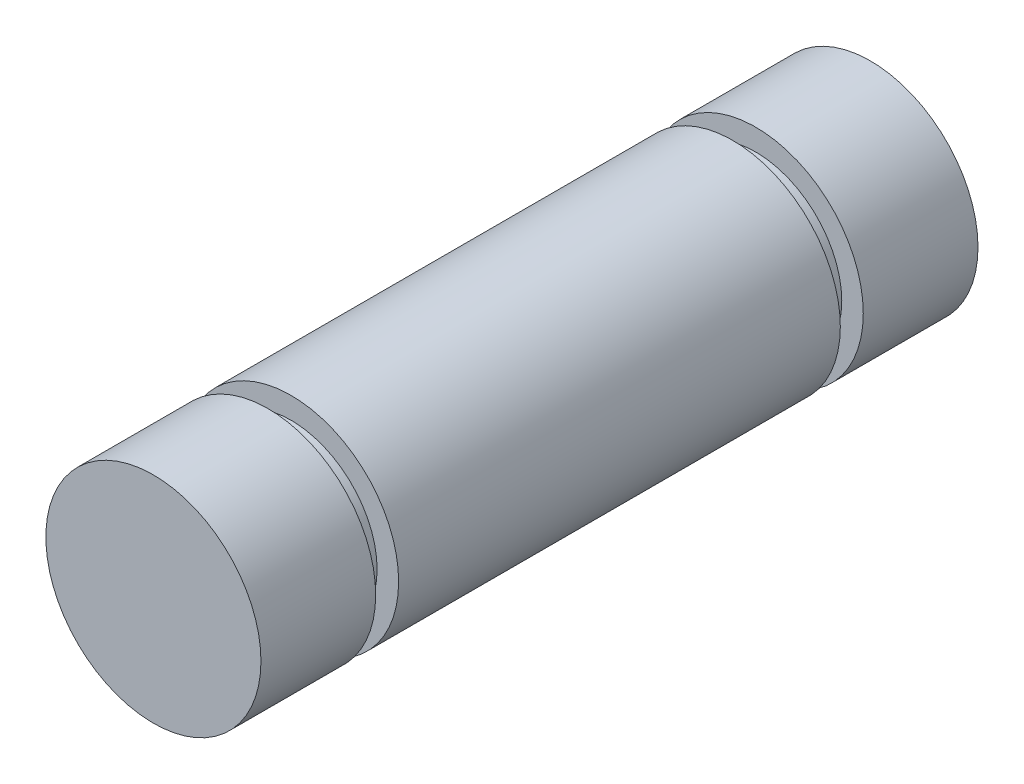
ISO-10303-21;
HEADER;
FILE_DESCRIPTION(('STEP AP214'),'2;1');
FILE_NAME('part.step','',(''),(''),'','','');
FILE_SCHEMA(('AUTOMOTIVE_DESIGN { 1 0 10303 214 1 1 1 1 }'));
ENDSEC;
DATA;
#1=APPLICATION_CONTEXT('core data for automotive mechanical design processes');
#2=APPLICATION_PROTOCOL_DEFINITION('international standard','automotive_design',2000,#1);
#3=PRODUCT_CONTEXT('',#1,'mechanical');
#4=PRODUCT('Part','Part','',(#3));
#5=PRODUCT_RELATED_PRODUCT_CATEGORY('part','',(#4));
#6=PRODUCT_DEFINITION_FORMATION('','',#4);
#7=PRODUCT_DEFINITION_CONTEXT('part definition',#1,'design');
#8=PRODUCT_DEFINITION('design','',#6,#7);
#9=PRODUCT_DEFINITION_SHAPE('','',#8);
#10=(LENGTH_UNIT() NAMED_UNIT(*) SI_UNIT(.MILLI.,.METRE.));
#11=(NAMED_UNIT(*) PLANE_ANGLE_UNIT() SI_UNIT($,.RADIAN.));
#12=(NAMED_UNIT(*) SI_UNIT($,.STERADIAN.) SOLID_ANGLE_UNIT());
#13=UNCERTAINTY_MEASURE_WITH_UNIT(LENGTH_MEASURE(1.E-05),#10,'distance_accuracy_value','');
#14=(GEOMETRIC_REPRESENTATION_CONTEXT(3) GLOBAL_UNCERTAINTY_ASSIGNED_CONTEXT((#13)) GLOBAL_UNIT_ASSIGNED_CONTEXT((#10,
#11,#12)) REPRESENTATION_CONTEXT('',''));
#15=CARTESIAN_POINT('',(0.,0.,0.));
#16=DIRECTION('',(0.,0.,1.));
#17=DIRECTION('',(1.,0.,0.));
#18=AXIS2_PLACEMENT_3D('',#15,#16,#17);
#19=CARTESIAN_POINT('',(0.,0.,15.875));
#20=DIRECTION('',(0.,0.,-1.));
#21=DIRECTION('',(-1.,0.,0.));
#22=AXIS2_PLACEMENT_3D('',#19,#20,#21);
#23=CYLINDRICAL_SURFACE('',#22,4.7625);
#24=CARTESIAN_POINT('',(0.,0.,-10.795));
#25=DIRECTION('',(0.,0.,1.));
#26=DIRECTION('',(1.,0.,0.));
#27=AXIS2_PLACEMENT_3D('',#24,#25,#26);
#28=CIRCLE('',#27,4.7625);
#29=CARTESIAN_POINT('',(4.7625,0.,-10.795));
#30=VERTEX_POINT('',#29);
#31=EDGE_CURVE('E59',#30,#30,#28,.T.);
#32=ORIENTED_EDGE('',*,*,#31,.F.);
#33=EDGE_LOOP('',(#32));
#34=FACE_BOUND('',#33,.T.);
#35=CARTESIAN_POINT('',(0.,0.,-15.875));
#36=DIRECTION('',(0.,0.,1.));
#37=DIRECTION('',(1.,0.,0.));
#38=AXIS2_PLACEMENT_3D('',#35,#36,#37);
#39=CIRCLE('',#38,4.7625);
#40=CARTESIAN_POINT('',(4.7625,0.,-15.875));
#41=VERTEX_POINT('',#40);
#42=EDGE_CURVE('E44',#41,#41,#39,.T.);
#43=ORIENTED_EDGE('',*,*,#42,.T.);
#44=EDGE_LOOP('',(#43));
#45=FACE_BOUND('',#44,.T.);
#46=ADVANCED_FACE('F41',(#34,#45),#23,.T.);
#47=CARTESIAN_POINT('',(0.,0.,-15.875));
#48=DIRECTION('',(0.,0.,1.));
#49=DIRECTION('',(1.,0.,0.));
#50=AXIS2_PLACEMENT_3D('',#47,#48,#49);
#51=PLANE('',#50);
#52=ORIENTED_EDGE('',*,*,#42,.F.);
#53=EDGE_LOOP('',(#52));
#54=FACE_BOUND('',#53,.T.);
#55=ADVANCED_FACE('F91',(#54),#51,.F.);
#56=CARTESIAN_POINT('',(4.7625,0.,-9.779));
#57=DIRECTION('',(0.,0.,1.));
#58=DIRECTION('',(1.,0.,0.));
#59=AXIS2_PLACEMENT_3D('',#56,#57,#58);
#60=PLANE('',#59);
#61=CARTESIAN_POINT('',(0.,0.,-9.779));
#62=DIRECTION('',(0.,0.,1.));
#63=DIRECTION('',(1.,0.,0.));
#64=AXIS2_PLACEMENT_3D('',#61,#62,#63);
#65=CIRCLE('',#64,4.7625);
#66=CARTESIAN_POINT('',(4.7625,0.,-9.779));
#67=VERTEX_POINT('',#66);
#68=EDGE_CURVE('E53',#67,#67,#65,.T.);
#69=ORIENTED_EDGE('',*,*,#68,.F.);
#70=EDGE_LOOP('',(#69));
#71=FACE_BOUND('',#70,.T.);
#72=CARTESIAN_POINT('',(0.,0.,-9.779));
#73=DIRECTION('',(0.,0.,1.));
#74=DIRECTION('',(1.,0.,0.));
#75=AXIS2_PLACEMENT_3D('',#72,#73,#74);
#76=CIRCLE('',#75,3.81);
#77=CARTESIAN_POINT('',(3.81,0.,-9.779));
#78=VERTEX_POINT('',#77);
#79=EDGE_CURVE('E75',#78,#78,#76,.T.);
#80=ORIENTED_EDGE('',*,*,#79,.T.);
#81=EDGE_LOOP('',(#80));
#82=FACE_BOUND('',#81,.T.);
#83=ADVANCED_FACE('F97',(#71,#82),#60,.F.);
#84=CARTESIAN_POINT('',(0.,0.,15.875));
#85=DIRECTION('',(0.,0.,1.));
#86=DIRECTION('',(1.,0.,0.));
#87=AXIS2_PLACEMENT_3D('',#84,#85,#86);
#88=CYLINDRICAL_SURFACE('',#87,3.81);
#89=ORIENTED_EDGE('',*,*,#79,.F.);
#90=EDGE_LOOP('',(#89));
#91=FACE_BOUND('',#90,.T.);
#92=CARTESIAN_POINT('',(0.,0.,-10.795));
#93=DIRECTION('',(0.,0.,1.));
#94=DIRECTION('',(1.,0.,0.));
#95=AXIS2_PLACEMENT_3D('',#92,#93,#94);
#96=CIRCLE('',#95,3.81);
#97=CARTESIAN_POINT('',(3.81,0.,-10.795));
#98=VERTEX_POINT('',#97);
#99=EDGE_CURVE('E79',#98,#98,#96,.T.);
#100=ORIENTED_EDGE('',*,*,#99,.T.);
#101=EDGE_LOOP('',(#100));
#102=FACE_BOUND('',#101,.T.);
#103=ADVANCED_FACE('F102',(#91,#102),#88,.T.);
#104=CARTESIAN_POINT('',(4.7625,0.,-10.795));
#105=DIRECTION('',(0.,0.,-1.));
#106=DIRECTION('',(-1.,0.,0.));
#107=AXIS2_PLACEMENT_3D('',#104,#105,#106);
#108=PLANE('',#107);
#109=ORIENTED_EDGE('',*,*,#99,.F.);
#110=EDGE_LOOP('',(#109));
#111=FACE_BOUND('',#110,.T.);
#112=ORIENTED_EDGE('',*,*,#31,.T.);
#113=EDGE_LOOP('',(#112));
#114=FACE_BOUND('',#113,.T.);
#115=ADVANCED_FACE('F87',(#111,#114),#108,.F.);
#116=ORIENTED_EDGE('',*,*,#68,.T.);
#117=EDGE_LOOP('',(#116));
#118=FACE_BOUND('',#117,.T.);
#119=CARTESIAN_POINT('',(0.,0.,9.779));
#120=DIRECTION('',(0.,0.,1.));
#121=DIRECTION('',(1.,0.,0.));
#122=AXIS2_PLACEMENT_3D('',#119,#120,#121);
#123=CIRCLE('',#122,4.7625);
#124=CARTESIAN_POINT('',(4.7625,0.,9.779));
#125=VERTEX_POINT('',#124);
#126=EDGE_CURVE('E68',#125,#125,#123,.T.);
#127=ORIENTED_EDGE('',*,*,#126,.F.);
#128=EDGE_LOOP('',(#127));
#129=FACE_BOUND('',#128,.T.);
#130=ADVANCED_FACE('F92',(#118,#129),#23,.T.);
#131=CARTESIAN_POINT('',(4.7625,0.,10.795));
#132=DIRECTION('',(0.,0.,1.));
#133=DIRECTION('',(1.,0.,0.));
#134=AXIS2_PLACEMENT_3D('',#131,#132,#133);
#135=PLANE('',#134);
#136=CARTESIAN_POINT('',(0.,0.,10.795));
#137=DIRECTION('',(0.,0.,1.));
#138=DIRECTION('',(1.,0.,0.));
#139=AXIS2_PLACEMENT_3D('',#136,#137,#138);
#140=CIRCLE('',#139,4.7625);
#141=CARTESIAN_POINT('',(4.7625,0.,10.795));
#142=VERTEX_POINT('',#141);
#143=EDGE_CURVE('E55',#142,#142,#140,.T.);
#144=ORIENTED_EDGE('',*,*,#143,.F.);
#145=EDGE_LOOP('',(#144));
#146=FACE_BOUND('',#145,.T.);
#147=CARTESIAN_POINT('',(0.,0.,10.795));
#148=DIRECTION('',(0.,0.,1.));
#149=DIRECTION('',(1.,0.,0.));
#150=AXIS2_PLACEMENT_3D('',#147,#148,#149);
#151=CIRCLE('',#150,3.81);
#152=CARTESIAN_POINT('',(3.81,0.,10.795));
#153=VERTEX_POINT('',#152);
#154=EDGE_CURVE('E60',#153,#153,#151,.T.);
#155=ORIENTED_EDGE('',*,*,#154,.T.);
#156=EDGE_LOOP('',(#155));
#157=FACE_BOUND('',#156,.T.);
#158=ADVANCED_FACE('F109',(#146,#157),#135,.F.);
#159=CARTESIAN_POINT('',(0.,0.,15.875));
#160=DIRECTION('',(0.,0.,1.));
#161=DIRECTION('',(1.,0.,0.));
#162=AXIS2_PLACEMENT_3D('',#159,#160,#161);
#163=CYLINDRICAL_SURFACE('',#162,3.81);
#164=ORIENTED_EDGE('',*,*,#154,.F.);
#165=EDGE_LOOP('',(#164));
#166=FACE_BOUND('',#165,.T.);
#167=CARTESIAN_POINT('',(0.,0.,9.779));
#168=DIRECTION('',(0.,0.,1.));
#169=DIRECTION('',(1.,0.,0.));
#170=AXIS2_PLACEMENT_3D('',#167,#168,#169);
#171=CIRCLE('',#170,3.81);
#172=CARTESIAN_POINT('',(3.81,0.,9.779));
#173=VERTEX_POINT('',#172);
#174=EDGE_CURVE('E64',#173,#173,#171,.T.);
#175=ORIENTED_EDGE('',*,*,#174,.T.);
#176=EDGE_LOOP('',(#175));
#177=FACE_BOUND('',#176,.T.);
#178=ADVANCED_FACE('F112',(#166,#177),#163,.T.);
#179=CARTESIAN_POINT('',(4.7625,0.,9.779));
#180=DIRECTION('',(0.,0.,-1.));
#181=DIRECTION('',(-1.,0.,0.));
#182=AXIS2_PLACEMENT_3D('',#179,#180,#181);
#183=PLANE('',#182);
#184=ORIENTED_EDGE('',*,*,#174,.F.);
#185=EDGE_LOOP('',(#184));
#186=FACE_BOUND('',#185,.T.);
#187=ORIENTED_EDGE('',*,*,#126,.T.);
#188=EDGE_LOOP('',(#187));
#189=FACE_BOUND('',#188,.T.);
#190=ADVANCED_FACE('F108',(#186,#189),#183,.F.);
#191=CARTESIAN_POINT('',(0.,0.,15.875));
#192=DIRECTION('',(0.,0.,1.));
#193=DIRECTION('',(1.,0.,0.));
#194=AXIS2_PLACEMENT_3D('',#191,#192,#193);
#195=PLANE('',#194);
#196=CARTESIAN_POINT('',(0.,0.,15.875));
#197=DIRECTION('',(0.,0.,1.));
#198=DIRECTION('',(1.,0.,0.));
#199=AXIS2_PLACEMENT_3D('',#196,#197,#198);
#200=CIRCLE('',#199,4.7625);
#201=CARTESIAN_POINT('',(4.7625,0.,15.875));
#202=VERTEX_POINT('',#201);
#203=EDGE_CURVE('E10',#202,#202,#200,.T.);
#204=ORIENTED_EDGE('',*,*,#203,.T.);
#205=EDGE_LOOP('',(#204));
#206=FACE_BOUND('',#205,.T.);
#207=ADVANCED_FACE('F106',(#206),#195,.T.);
#208=ORIENTED_EDGE('',*,*,#143,.T.);
#209=EDGE_LOOP('',(#208));
#210=FACE_BOUND('',#209,.T.);
#211=ORIENTED_EDGE('',*,*,#203,.F.);
#212=EDGE_LOOP('',(#211));
#213=FACE_BOUND('',#212,.T.);
#214=ADVANCED_FACE('F93',(#210,#213),#23,.T.);
#215=CLOSED_SHELL('',(#46,#55,#83,#103,#115,#130,#158,#178,#190,#207,#214));
#216=MANIFOLD_SOLID_BREP('B2',#215);
#217=ADVANCED_BREP_SHAPE_REPRESENTATION('',(#18,#216),#14);
#218=SHAPE_DEFINITION_REPRESENTATION(#9,#217);
ENDSEC;
END-ISO-10303-21;
